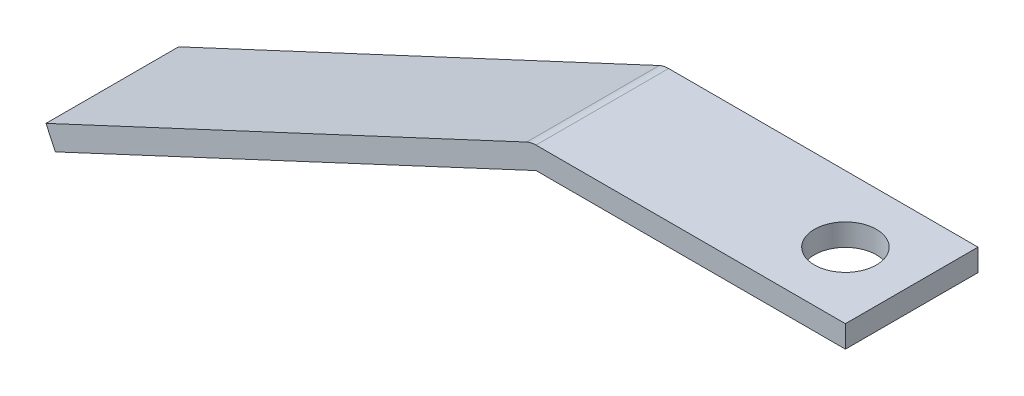
ISO-10303-21;
HEADER;
FILE_DESCRIPTION(('STEP AP214'),'2;1');
FILE_NAME('part.step','',(''),(''),'','','');
FILE_SCHEMA(('AUTOMOTIVE_DESIGN { 1 0 10303 214 1 1 1 1 }'));
ENDSEC;
DATA;
#1=APPLICATION_CONTEXT('core data for automotive mechanical design processes');
#2=APPLICATION_PROTOCOL_DEFINITION('international standard','automotive_design',2000,#1);
#3=PRODUCT_CONTEXT('',#1,'mechanical');
#4=PRODUCT('Part','Part','',(#3));
#5=PRODUCT_RELATED_PRODUCT_CATEGORY('part','',(#4));
#6=PRODUCT_DEFINITION_FORMATION('','',#4);
#7=PRODUCT_DEFINITION_CONTEXT('part definition',#1,'design');
#8=PRODUCT_DEFINITION('design','',#6,#7);
#9=PRODUCT_DEFINITION_SHAPE('','',#8);
#10=(LENGTH_UNIT() NAMED_UNIT(*) SI_UNIT(.MILLI.,.METRE.));
#11=(NAMED_UNIT(*) PLANE_ANGLE_UNIT() SI_UNIT($,.RADIAN.));
#12=(NAMED_UNIT(*) SI_UNIT($,.STERADIAN.) SOLID_ANGLE_UNIT());
#13=UNCERTAINTY_MEASURE_WITH_UNIT(LENGTH_MEASURE(1.E-05),#10,'distance_accuracy_value','');
#14=(GEOMETRIC_REPRESENTATION_CONTEXT(3) GLOBAL_UNCERTAINTY_ASSIGNED_CONTEXT((#13)) GLOBAL_UNIT_ASSIGNED_CONTEXT((#10,
#11,#12)) REPRESENTATION_CONTEXT('',''));
#15=CARTESIAN_POINT('',(0.,0.,0.));
#16=DIRECTION('',(0.,0.,1.));
#17=DIRECTION('',(1.,0.,0.));
#18=AXIS2_PLACEMENT_3D('',#15,#16,#17);
#19=CARTESIAN_POINT('',(0.,0.,38.1));
#20=DIRECTION('',(-1.,0.,0.));
#21=DIRECTION('',(0.,0.,1.));
#22=AXIS2_PLACEMENT_3D('',#19,#20,#21);
#23=PLANE('',#22);
#24=DIRECTION('',(0.,1.,0.));
#25=VECTOR('',#24,1.);
#26=CARTESIAN_POINT('',(0.,0.,-38.1));
#27=LINE('',#26,#25);
#28=CARTESIAN_POINT('',(0.,0.,-38.1));
#29=VERTEX_POINT('',#28);
#30=CARTESIAN_POINT('',(0.,12.7,-38.1));
#31=VERTEX_POINT('',#30);
#32=EDGE_CURVE('E124',#29,#31,#27,.T.);
#33=ORIENTED_EDGE('',*,*,#32,.T.);
#34=DIRECTION('',(0.,0.,-1.));
#35=VECTOR('',#34,1.);
#36=CARTESIAN_POINT('',(0.,12.7,38.1));
#37=LINE('',#36,#35);
#38=CARTESIAN_POINT('',(0.,12.7,38.1));
#39=VERTEX_POINT('',#38);
#40=EDGE_CURVE('E11',#39,#31,#37,.T.);
#41=ORIENTED_EDGE('',*,*,#40,.F.);
#42=DIRECTION('',(0.,1.,0.));
#43=VECTOR('',#42,1.);
#44=CARTESIAN_POINT('',(0.,0.,38.1));
#45=LINE('',#44,#43);
#46=CARTESIAN_POINT('',(0.,0.,38.1));
#47=VERTEX_POINT('',#46);
#48=EDGE_CURVE('E136',#47,#39,#45,.T.);
#49=ORIENTED_EDGE('',*,*,#48,.F.);
#50=DIRECTION('',(0.,0.,-1.));
#51=VECTOR('',#50,1.);
#52=CARTESIAN_POINT('',(0.,0.,38.1));
#53=LINE('',#52,#51);
#54=EDGE_CURVE('E120',#47,#29,#53,.T.);
#55=ORIENTED_EDGE('',*,*,#54,.T.);
#56=EDGE_LOOP('',(#33,#41,#49,#55));
#57=FACE_BOUND('',#56,.T.);
#58=ADVANCED_FACE('F33',(#57),#23,.F.);
#59=CARTESIAN_POINT('',(0.,12.7,38.1));
#60=DIRECTION('',(0.,-1.,0.));
#61=DIRECTION('',(1.,0.,0.));
#62=AXIS2_PLACEMENT_3D('',#59,#60,#61);
#63=PLANE('',#62);
#64=CARTESIAN_POINT('',(-38.1,12.7,0.));
#65=DIRECTION('',(0.,1.,0.));
#66=DIRECTION('',(-1.,0.,0.));
#67=AXIS2_PLACEMENT_3D('',#64,#65,#66);
#68=CIRCLE('',#67,17.78);
#69=CARTESIAN_POINT('',(-55.88,12.7,0.));
#70=VERTEX_POINT('',#69);
#71=EDGE_CURVE('E160',#70,#70,#68,.T.);
#72=ORIENTED_EDGE('',*,*,#71,.F.);
#73=EDGE_LOOP('',(#72));
#74=FACE_BOUND('',#73,.T.);
#75=DIRECTION('',(-1.,0.,0.));
#76=VECTOR('',#75,1.);
#77=CARTESIAN_POINT('',(0.,12.7,-38.1));
#78=LINE('',#77,#76);
#79=CARTESIAN_POINT('',(-177.8,12.7,-38.1));
#80=VERTEX_POINT('',#79);
#81=EDGE_CURVE('E127',#31,#80,#78,.T.);
#82=ORIENTED_EDGE('',*,*,#81,.T.);
#83=DIRECTION('',(0.,0.,-1.));
#84=VECTOR('',#83,1.);
#85=CARTESIAN_POINT('',(-177.8,12.7,38.1));
#86=LINE('',#85,#84);
#87=CARTESIAN_POINT('',(-177.8,12.7,38.1));
#88=VERTEX_POINT('',#87);
#89=EDGE_CURVE('E42',#88,#80,#86,.T.);
#90=ORIENTED_EDGE('',*,*,#89,.F.);
#91=DIRECTION('',(-1.,0.,0.));
#92=VECTOR('',#91,1.);
#93=CARTESIAN_POINT('',(0.,12.7,38.1));
#94=LINE('',#93,#92);
#95=EDGE_CURVE('E90',#39,#88,#94,.T.);
#96=ORIENTED_EDGE('',*,*,#95,.F.);
#97=ORIENTED_EDGE('',*,*,#40,.T.);
#98=EDGE_LOOP('',(#82,#90,#96,#97));
#99=FACE_BOUND('',#98,.T.);
#100=ADVANCED_FACE('F178',(#74,#99),#63,.F.);
#101=CARTESIAN_POINT('',(-177.800000000001,1.85268467234323E-12,38.1));
#102=DIRECTION('',(0.,0.,-1.));
#103=DIRECTION('',(-1.,0.,0.));
#104=AXIS2_PLACEMENT_3D('',#101,#102,#103);
#105=CYLINDRICAL_SURFACE('',#104,12.6999999999981);
#106=CARTESIAN_POINT('',(-177.800000000001,1.85268467234323E-12,-38.1));
#107=DIRECTION('',(0.,0.,1.));
#108=DIRECTION('',(-1.,0.,0.));
#109=AXIS2_PLACEMENT_3D('',#106,#107,#108);
#110=CIRCLE('',#109,12.6999999999981);
#111=CARTESIAN_POINT('',(-183.167251924107,11.5101088953656,-38.1));
#112=VERTEX_POINT('',#111);
#113=EDGE_CURVE('E129',#80,#112,#110,.T.);
#114=ORIENTED_EDGE('',*,*,#113,.T.);
#115=DIRECTION('',(0.,0.,-1.));
#116=VECTOR('',#115,1.);
#117=CARTESIAN_POINT('',(-183.167251924107,11.5101088953656,38.1));
#118=LINE('',#117,#116);
#119=CARTESIAN_POINT('',(-183.167251924107,11.5101088953656,38.1));
#120=VERTEX_POINT('',#119);
#121=EDGE_CURVE('E140',#120,#112,#118,.T.);
#122=ORIENTED_EDGE('',*,*,#121,.F.);
#123=CARTESIAN_POINT('',(-177.800000000001,1.85268467234323E-12,38.1));
#124=DIRECTION('',(0.,0.,1.));
#125=DIRECTION('',(-1.,0.,0.));
#126=AXIS2_PLACEMENT_3D('',#123,#124,#125);
#127=CIRCLE('',#126,12.6999999999981);
#128=EDGE_CURVE('E149',#88,#120,#127,.T.);
#129=ORIENTED_EDGE('',*,*,#128,.F.);
#130=ORIENTED_EDGE('',*,*,#89,.T.);
#131=EDGE_LOOP('',(#114,#122,#129,#130));
#132=FACE_BOUND('',#131,.T.);
#133=ADVANCED_FACE('F147',(#132),#105,.T.);
#134=CARTESIAN_POINT('',(-183.167251924107,11.5101088953656,38.1));
#135=DIRECTION('',(0.4226182617407,-0.90630778703665,0.));
#136=DIRECTION('',(0.90630778703665,0.4226182617407,0.));
#137=AXIS2_PLACEMENT_3D('',#134,#135,#136);
#138=PLANE('',#137);
#139=DIRECTION('',(-0.90630778703665,-0.4226182617407,0.));
#140=VECTOR('',#139,1.);
#141=CARTESIAN_POINT('',(-183.167251924107,11.5101088953656,-38.1));
#142=LINE('',#141,#140);
#143=CARTESIAN_POINT('',(-459.409865412878,-117.3039372832,-38.1));
#144=VERTEX_POINT('',#143);
#145=EDGE_CURVE('E131',#112,#144,#142,.T.);
#146=ORIENTED_EDGE('',*,*,#145,.T.);
#147=DIRECTION('',(0.,0.,-1.));
#148=VECTOR('',#147,1.);
#149=CARTESIAN_POINT('',(-459.409865412878,-117.3039372832,38.1));
#150=LINE('',#149,#148);
#151=CARTESIAN_POINT('',(-459.409865412878,-117.3039372832,38.1));
#152=VERTEX_POINT('',#151);
#153=EDGE_CURVE('E115',#152,#144,#150,.T.);
#154=ORIENTED_EDGE('',*,*,#153,.F.);
#155=DIRECTION('',(-0.90630778703665,-0.4226182617407,0.));
#156=VECTOR('',#155,1.);
#157=CARTESIAN_POINT('',(-183.167251924107,11.5101088953656,38.1));
#158=LINE('',#157,#156);
#159=EDGE_CURVE('E106',#120,#152,#158,.T.);
#160=ORIENTED_EDGE('',*,*,#159,.F.);
#161=ORIENTED_EDGE('',*,*,#121,.T.);
#162=EDGE_LOOP('',(#146,#154,#160,#161));
#163=FACE_BOUND('',#162,.T.);
#164=ADVANCED_FACE('F155',(#163),#138,.F.);
#165=CARTESIAN_POINT('',(-454.042613488771,-128.814046178565,38.1));
#166=DIRECTION('',(0.906307787036649,0.422618261740702,0.));
#167=DIRECTION('',(-0.422618261740702,0.906307787036649,0.));
#168=AXIS2_PLACEMENT_3D('',#165,#166,#167);
#169=PLANE('',#168);
#170=DIRECTION('',(0.422618261740702,-0.906307787036649,0.));
#171=VECTOR('',#170,1.);
#172=CARTESIAN_POINT('',(-454.042613488771,-128.814046178565,-38.1));
#173=LINE('',#172,#171);
#174=CARTESIAN_POINT('',(-454.042613488771,-128.814046178565,-38.1));
#175=VERTEX_POINT('',#174);
#176=EDGE_CURVE('E114',#144,#175,#173,.T.);
#177=ORIENTED_EDGE('',*,*,#176,.T.);
#178=DIRECTION('',(0.,0.,-1.));
#179=VECTOR('',#178,1.);
#180=CARTESIAN_POINT('',(-454.042613488771,-128.814046178565,38.1));
#181=LINE('',#180,#179);
#182=CARTESIAN_POINT('',(-454.042613488771,-128.814046178565,38.1));
#183=VERTEX_POINT('',#182);
#184=EDGE_CURVE('E111',#183,#175,#181,.T.);
#185=ORIENTED_EDGE('',*,*,#184,.F.);
#186=DIRECTION('',(0.422618261740702,-0.906307787036649,0.));
#187=VECTOR('',#186,1.);
#188=CARTESIAN_POINT('',(-454.042613488771,-128.814046178565,38.1));
#189=LINE('',#188,#187);
#190=EDGE_CURVE('E100',#152,#183,#189,.T.);
#191=ORIENTED_EDGE('',*,*,#190,.F.);
#192=ORIENTED_EDGE('',*,*,#153,.T.);
#193=EDGE_LOOP('',(#177,#185,#191,#192));
#194=FACE_BOUND('',#193,.T.);
#195=ADVANCED_FACE('F112',(#194),#169,.F.);
#196=CARTESIAN_POINT('',(-177.8,0.,38.1));
#197=DIRECTION('',(-0.422618261740699,0.90630778703665,0.));
#198=DIRECTION('',(-0.90630778703665,-0.422618261740699,0.));
#199=AXIS2_PLACEMENT_3D('',#196,#197,#198);
#200=PLANE('',#199);
#201=DIRECTION('',(0.90630778703665,0.422618261740699,0.));
#202=VECTOR('',#201,1.);
#203=CARTESIAN_POINT('',(-177.8,0.,-38.1));
#204=LINE('',#203,#202);
#205=CARTESIAN_POINT('',(-177.8,0.,-38.1));
#206=VERTEX_POINT('',#205);
#207=EDGE_CURVE('E76',#175,#206,#204,.T.);
#208=ORIENTED_EDGE('',*,*,#207,.T.);
#209=DIRECTION('',(0.,0.,-1.));
#210=VECTOR('',#209,1.);
#211=CARTESIAN_POINT('',(-177.8,0.,38.1));
#212=LINE('',#211,#210);
#213=CARTESIAN_POINT('',(-177.8,0.,38.1));
#214=VERTEX_POINT('',#213);
#215=EDGE_CURVE('E116',#214,#206,#212,.T.);
#216=ORIENTED_EDGE('',*,*,#215,.F.);
#217=DIRECTION('',(0.90630778703665,0.422618261740699,0.));
#218=VECTOR('',#217,1.);
#219=CARTESIAN_POINT('',(-177.8,0.,38.1));
#220=LINE('',#219,#218);
#221=EDGE_CURVE('E104',#183,#214,#220,.T.);
#222=ORIENTED_EDGE('',*,*,#221,.F.);
#223=ORIENTED_EDGE('',*,*,#184,.T.);
#224=EDGE_LOOP('',(#208,#216,#222,#223));
#225=FACE_BOUND('',#224,.T.);
#226=ADVANCED_FACE('F118',(#225),#200,.F.);
#227=CARTESIAN_POINT('',(0.,0.,38.1));
#228=DIRECTION('',(0.,1.,0.));
#229=DIRECTION('',(-1.,0.,0.));
#230=AXIS2_PLACEMENT_3D('',#227,#228,#229);
#231=PLANE('',#230);
#232=CARTESIAN_POINT('',(-38.1,0.,0.));
#233=DIRECTION('',(0.,1.,0.));
#234=DIRECTION('',(-1.,0.,0.));
#235=AXIS2_PLACEMENT_3D('',#232,#233,#234);
#236=CIRCLE('',#235,17.78);
#237=CARTESIAN_POINT('',(-55.88,0.,0.));
#238=VERTEX_POINT('',#237);
#239=EDGE_CURVE('E36',#238,#238,#236,.T.);
#240=ORIENTED_EDGE('',*,*,#239,.T.);
#241=EDGE_LOOP('',(#240));
#242=FACE_BOUND('',#241,.T.);
#243=DIRECTION('',(1.,0.,0.));
#244=VECTOR('',#243,1.);
#245=CARTESIAN_POINT('',(0.,0.,-38.1));
#246=LINE('',#245,#244);
#247=EDGE_CURVE('E82',#206,#29,#246,.T.);
#248=ORIENTED_EDGE('',*,*,#247,.T.);
#249=ORIENTED_EDGE('',*,*,#54,.F.);
#250=DIRECTION('',(1.,0.,0.));
#251=VECTOR('',#250,1.);
#252=CARTESIAN_POINT('',(0.,0.,38.1));
#253=LINE('',#252,#251);
#254=EDGE_CURVE('E50',#214,#47,#253,.T.);
#255=ORIENTED_EDGE('',*,*,#254,.F.);
#256=ORIENTED_EDGE('',*,*,#215,.T.);
#257=EDGE_LOOP('',(#248,#249,#255,#256));
#258=FACE_BOUND('',#257,.T.);
#259=ADVANCED_FACE('F167',(#242,#258),#231,.F.);
#260=CARTESIAN_POINT('',(-177.800000000001,1.85268467234323E-12,38.1));
#261=DIRECTION('',(0.,0.,-1.));
#262=DIRECTION('',(-1.,0.,0.));
#263=AXIS2_PLACEMENT_3D('',#260,#261,#262);
#264=PLANE('',#263);
#265=ORIENTED_EDGE('',*,*,#48,.T.);
#266=ORIENTED_EDGE('',*,*,#95,.T.);
#267=ORIENTED_EDGE('',*,*,#128,.T.);
#268=ORIENTED_EDGE('',*,*,#159,.T.);
#269=ORIENTED_EDGE('',*,*,#190,.T.);
#270=ORIENTED_EDGE('',*,*,#221,.T.);
#271=ORIENTED_EDGE('',*,*,#254,.T.);
#272=EDGE_LOOP('',(#265,#266,#267,#268,#269,#270,#271));
#273=FACE_BOUND('',#272,.T.);
#274=ADVANCED_FACE('F102',(#273),#264,.F.);
#275=CARTESIAN_POINT('',(-177.800000000001,1.85268467234323E-12,-38.1));
#276=DIRECTION('',(0.,0.,-1.));
#277=DIRECTION('',(-1.,0.,0.));
#278=AXIS2_PLACEMENT_3D('',#275,#276,#277);
#279=PLANE('',#278);
#280=ORIENTED_EDGE('',*,*,#32,.F.);
#281=ORIENTED_EDGE('',*,*,#247,.F.);
#282=ORIENTED_EDGE('',*,*,#207,.F.);
#283=ORIENTED_EDGE('',*,*,#176,.F.);
#284=ORIENTED_EDGE('',*,*,#145,.F.);
#285=ORIENTED_EDGE('',*,*,#113,.F.);
#286=ORIENTED_EDGE('',*,*,#81,.F.);
#287=EDGE_LOOP('',(#280,#281,#282,#283,#284,#285,#286));
#288=FACE_BOUND('',#287,.T.);
#289=ADVANCED_FACE('F153',(#288),#279,.T.);
#290=CARTESIAN_POINT('',(-38.1,-128.814046178565,0.));
#291=DIRECTION('',(0.,1.,0.));
#292=DIRECTION('',(-1.,0.,0.));
#293=AXIS2_PLACEMENT_3D('',#290,#291,#292);
#294=CYLINDRICAL_SURFACE('',#293,17.78);
#295=ORIENTED_EDGE('',*,*,#71,.T.);
#296=EDGE_LOOP('',(#295));
#297=FACE_BOUND('',#296,.T.);
#298=ORIENTED_EDGE('',*,*,#239,.F.);
#299=EDGE_LOOP('',(#298));
#300=FACE_BOUND('',#299,.T.);
#301=ADVANCED_FACE('F169',(#297,#300),#294,.F.);
#302=CLOSED_SHELL('',(#58,#100,#133,#164,#195,#226,#259,#274,#289,#301));
#303=MANIFOLD_SOLID_BREP('B2',#302);
#304=ADVANCED_BREP_SHAPE_REPRESENTATION('',(#18,#303),#14);
#305=SHAPE_DEFINITION_REPRESENTATION(#9,#304);
ENDSEC;
END-ISO-10303-21;
